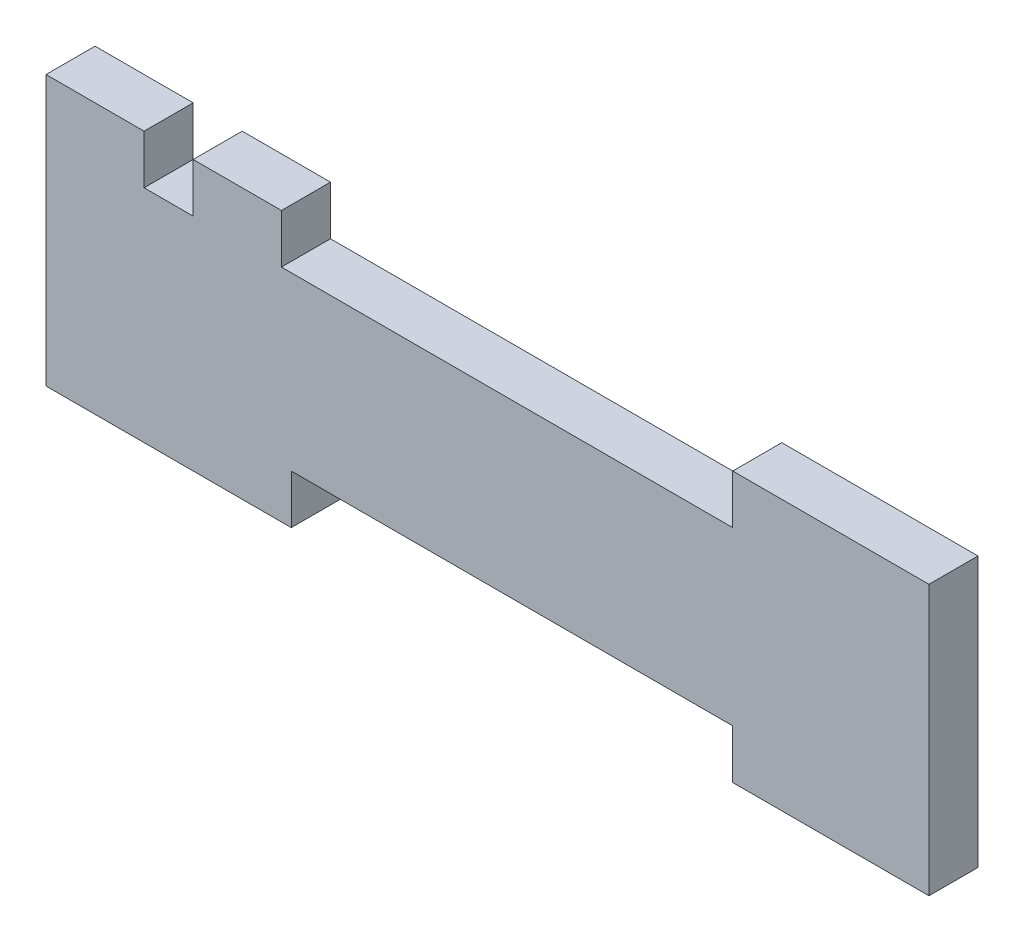
ISO-10303-21;
HEADER;
FILE_DESCRIPTION(('STEP AP214'),'2;1');
FILE_NAME('part.step','',(''),(''),'','','');
FILE_SCHEMA(('AUTOMOTIVE_DESIGN { 1 0 10303 214 1 1 1 1 }'));
ENDSEC;
DATA;
#1=APPLICATION_CONTEXT('core data for automotive mechanical design processes');
#2=APPLICATION_PROTOCOL_DEFINITION('international standard','automotive_design',2000,#1);
#3=PRODUCT_CONTEXT('',#1,'mechanical');
#4=PRODUCT('Part','Part','',(#3));
#5=PRODUCT_RELATED_PRODUCT_CATEGORY('part','',(#4));
#6=PRODUCT_DEFINITION_FORMATION('','',#4);
#7=PRODUCT_DEFINITION_CONTEXT('part definition',#1,'design');
#8=PRODUCT_DEFINITION('design','',#6,#7);
#9=PRODUCT_DEFINITION_SHAPE('','',#8);
#10=(LENGTH_UNIT() NAMED_UNIT(*) SI_UNIT(.MILLI.,.METRE.));
#11=(NAMED_UNIT(*) PLANE_ANGLE_UNIT() SI_UNIT($,.RADIAN.));
#12=(NAMED_UNIT(*) SI_UNIT($,.STERADIAN.) SOLID_ANGLE_UNIT());
#13=UNCERTAINTY_MEASURE_WITH_UNIT(LENGTH_MEASURE(1.E-05),#10,'distance_accuracy_value','');
#14=(GEOMETRIC_REPRESENTATION_CONTEXT(3) GLOBAL_UNCERTAINTY_ASSIGNED_CONTEXT((#13)) GLOBAL_UNIT_ASSIGNED_CONTEXT((#10,
#11,#12)) REPRESENTATION_CONTEXT('',''));
#15=CARTESIAN_POINT('',(0.,0.,0.));
#16=DIRECTION('',(0.,0.,1.));
#17=DIRECTION('',(1.,0.,0.));
#18=AXIS2_PLACEMENT_3D('',#15,#16,#17);
#19=CARTESIAN_POINT('',(0.,22.5,5.));
#20=DIRECTION('',(0.,1.,0.));
#21=DIRECTION('',(0.,0.,1.));
#22=AXIS2_PLACEMENT_3D('',#19,#20,#21);
#23=PLANE('',#22);
#24=DIRECTION('',(1.,0.,0.));
#25=VECTOR('',#24,1.);
#26=CARTESIAN_POINT('',(0.,22.5,5.));
#27=LINE('',#26,#25);
#28=CARTESIAN_POINT('',(-75.,22.5,5.));
#29=VERTEX_POINT('',#28);
#30=CARTESIAN_POINT('',(-66.,22.5,5.));
#31=VERTEX_POINT('',#30);
#32=EDGE_CURVE('E273',#29,#31,#27,.T.);
#33=ORIENTED_EDGE('',*,*,#32,.T.);
#34=DIRECTION('',(0.,0.,1.));
#35=VECTOR('',#34,1.);
#36=CARTESIAN_POINT('',(-66.,22.5,0.));
#37=LINE('',#36,#35);
#38=CARTESIAN_POINT('',(-66.,22.5,0.));
#39=VERTEX_POINT('',#38);
#40=EDGE_CURVE('E281',#39,#31,#37,.T.);
#41=ORIENTED_EDGE('',*,*,#40,.F.);
#42=DIRECTION('',(1.,0.,0.));
#43=VECTOR('',#42,1.);
#44=CARTESIAN_POINT('',(0.,22.5,0.));
#45=LINE('',#44,#43);
#46=CARTESIAN_POINT('',(-75.,22.5,0.));
#47=VERTEX_POINT('',#46);
#48=EDGE_CURVE('E204',#47,#39,#45,.T.);
#49=ORIENTED_EDGE('',*,*,#48,.F.);
#50=DIRECTION('',(0.,0.,-1.));
#51=VECTOR('',#50,1.);
#52=CARTESIAN_POINT('',(-75.,22.5,5.));
#53=LINE('',#52,#51);
#54=EDGE_CURVE('E218',#29,#47,#53,.T.);
#55=ORIENTED_EDGE('',*,*,#54,.F.);
#56=EDGE_LOOP('',(#33,#41,#49,#55));
#57=FACE_BOUND('',#56,.T.);
#58=ADVANCED_FACE('F32',(#57),#23,.T.);
#59=CARTESIAN_POINT('',(-90.,0.,5.));
#60=DIRECTION('',(-1.,0.,0.));
#61=DIRECTION('',(0.,0.,1.));
#62=AXIS2_PLACEMENT_3D('',#59,#60,#61);
#63=PLANE('',#62);
#64=DIRECTION('',(0.,1.,0.));
#65=VECTOR('',#64,1.);
#66=CARTESIAN_POINT('',(-90.,0.,0.));
#67=LINE('',#66,#65);
#68=CARTESIAN_POINT('',(-90.,-5.00000000000001,0.));
#69=VERTEX_POINT('',#68);
#70=CARTESIAN_POINT('',(-90.,22.5,0.));
#71=VERTEX_POINT('',#70);
#72=EDGE_CURVE('E177',#69,#71,#67,.T.);
#73=ORIENTED_EDGE('',*,*,#72,.F.);
#74=DIRECTION('',(0.,0.,-1.));
#75=VECTOR('',#74,1.);
#76=CARTESIAN_POINT('',(-90.,-5.00000000000001,5.));
#77=LINE('',#76,#75);
#78=CARTESIAN_POINT('',(-90.,-5.00000000000001,5.));
#79=VERTEX_POINT('',#78);
#80=EDGE_CURVE('E11',#79,#69,#77,.T.);
#81=ORIENTED_EDGE('',*,*,#80,.F.);
#82=DIRECTION('',(0.,1.,0.));
#83=VECTOR('',#82,1.);
#84=CARTESIAN_POINT('',(-90.,0.,5.));
#85=LINE('',#84,#83);
#86=CARTESIAN_POINT('',(-90.,22.5,5.));
#87=VERTEX_POINT('',#86);
#88=EDGE_CURVE('E214',#79,#87,#85,.T.);
#89=ORIENTED_EDGE('',*,*,#88,.T.);
#90=DIRECTION('',(0.,0.,-1.));
#91=VECTOR('',#90,1.);
#92=CARTESIAN_POINT('',(-90.,22.5,5.));
#93=LINE('',#92,#91);
#94=EDGE_CURVE('E56',#87,#71,#93,.T.);
#95=ORIENTED_EDGE('',*,*,#94,.T.);
#96=EDGE_LOOP('',(#73,#81,#89,#95));
#97=FACE_BOUND('',#96,.T.);
#98=ADVANCED_FACE('F34',(#97),#63,.T.);
#99=CARTESIAN_POINT('',(0.,-5.00000000000001,5.));
#100=DIRECTION('',(0.,1.,0.));
#101=DIRECTION('',(0.,0.,1.));
#102=AXIS2_PLACEMENT_3D('',#99,#100,#101);
#103=PLANE('',#102);
#104=DIRECTION('',(1.,0.,0.));
#105=VECTOR('',#104,1.);
#106=CARTESIAN_POINT('',(0.,-5.00000000000001,0.));
#107=LINE('',#106,#105);
#108=CARTESIAN_POINT('',(-65.,-5.00000000000001,0.));
#109=VERTEX_POINT('',#108);
#110=EDGE_CURVE('E179',#69,#109,#107,.T.);
#111=ORIENTED_EDGE('',*,*,#110,.T.);
#112=DIRECTION('',(0.,0.,-1.));
#113=VECTOR('',#112,1.);
#114=CARTESIAN_POINT('',(-65.,-5.00000000000001,5.));
#115=LINE('',#114,#113);
#116=CARTESIAN_POINT('',(-65.,-5.00000000000001,5.));
#117=VERTEX_POINT('',#116);
#118=EDGE_CURVE('E40',#117,#109,#115,.T.);
#119=ORIENTED_EDGE('',*,*,#118,.F.);
#120=DIRECTION('',(1.,0.,0.));
#121=VECTOR('',#120,1.);
#122=CARTESIAN_POINT('',(0.,-5.00000000000001,5.));
#123=LINE('',#122,#121);
#124=EDGE_CURVE('E256',#79,#117,#123,.T.);
#125=ORIENTED_EDGE('',*,*,#124,.F.);
#126=ORIENTED_EDGE('',*,*,#80,.T.);
#127=EDGE_LOOP('',(#111,#119,#125,#126));
#128=FACE_BOUND('',#127,.T.);
#129=ADVANCED_FACE('F243',(#128),#103,.F.);
#130=CARTESIAN_POINT('',(-65.,0.,5.));
#131=DIRECTION('',(1.,0.,0.));
#132=DIRECTION('',(0.,0.,-1.));
#133=AXIS2_PLACEMENT_3D('',#130,#131,#132);
#134=PLANE('',#133);
#135=DIRECTION('',(0.,-1.,0.));
#136=VECTOR('',#135,1.);
#137=CARTESIAN_POINT('',(-65.,0.,0.));
#138=LINE('',#137,#136);
#139=CARTESIAN_POINT('',(-65.,0.,0.));
#140=VERTEX_POINT('',#139);
#141=EDGE_CURVE('E183',#140,#109,#138,.T.);
#142=ORIENTED_EDGE('',*,*,#141,.F.);
#143=DIRECTION('',(0.,0.,-1.));
#144=VECTOR('',#143,1.);
#145=CARTESIAN_POINT('',(-65.,0.,5.));
#146=LINE('',#145,#144);
#147=CARTESIAN_POINT('',(-65.,0.,5.));
#148=VERTEX_POINT('',#147);
#149=EDGE_CURVE('E233',#148,#140,#146,.T.);
#150=ORIENTED_EDGE('',*,*,#149,.F.);
#151=DIRECTION('',(0.,-1.,0.));
#152=VECTOR('',#151,1.);
#153=CARTESIAN_POINT('',(-65.,0.,5.));
#154=LINE('',#153,#152);
#155=EDGE_CURVE('E240',#148,#117,#154,.T.);
#156=ORIENTED_EDGE('',*,*,#155,.T.);
#157=ORIENTED_EDGE('',*,*,#118,.T.);
#158=EDGE_LOOP('',(#142,#150,#156,#157));
#159=FACE_BOUND('',#158,.T.);
#160=ADVANCED_FACE('F238',(#159),#134,.T.);
#161=CARTESIAN_POINT('',(0.,0.,5.));
#162=DIRECTION('',(0.,-1.,0.));
#163=DIRECTION('',(1.,0.,0.));
#164=AXIS2_PLACEMENT_3D('',#161,#162,#163);
#165=PLANE('',#164);
#166=DIRECTION('',(-1.,0.,0.));
#167=VECTOR('',#166,1.);
#168=CARTESIAN_POINT('',(0.,0.,0.));
#169=LINE('',#168,#167);
#170=CARTESIAN_POINT('',(-20.,0.,0.));
#171=VERTEX_POINT('',#170);
#172=EDGE_CURVE('E186',#171,#140,#169,.T.);
#173=ORIENTED_EDGE('',*,*,#172,.F.);
#174=DIRECTION('',(0.,0.,-1.));
#175=VECTOR('',#174,1.);
#176=CARTESIAN_POINT('',(-20.,0.,5.));
#177=LINE('',#176,#175);
#178=CARTESIAN_POINT('',(-20.,0.,5.));
#179=VERTEX_POINT('',#178);
#180=EDGE_CURVE('E231',#179,#171,#177,.T.);
#181=ORIENTED_EDGE('',*,*,#180,.F.);
#182=DIRECTION('',(-1.,0.,0.));
#183=VECTOR('',#182,1.);
#184=CARTESIAN_POINT('',(0.,0.,5.));
#185=LINE('',#184,#183);
#186=EDGE_CURVE('E254',#179,#148,#185,.T.);
#187=ORIENTED_EDGE('',*,*,#186,.T.);
#188=ORIENTED_EDGE('',*,*,#149,.T.);
#189=EDGE_LOOP('',(#173,#181,#187,#188));
#190=FACE_BOUND('',#189,.T.);
#191=ADVANCED_FACE('F250',(#190),#165,.T.);
#192=CARTESIAN_POINT('',(-20.,0.,5.));
#193=DIRECTION('',(1.,0.,0.));
#194=DIRECTION('',(0.,0.,-1.));
#195=AXIS2_PLACEMENT_3D('',#192,#193,#194);
#196=PLANE('',#195);
#197=DIRECTION('',(0.,-1.,0.));
#198=VECTOR('',#197,1.);
#199=CARTESIAN_POINT('',(-20.,0.,0.));
#200=LINE('',#199,#198);
#201=CARTESIAN_POINT('',(-20.,-5.00000000000001,0.));
#202=VERTEX_POINT('',#201);
#203=EDGE_CURVE('E189',#171,#202,#200,.T.);
#204=ORIENTED_EDGE('',*,*,#203,.T.);
#205=DIRECTION('',(0.,0.,-1.));
#206=VECTOR('',#205,1.);
#207=CARTESIAN_POINT('',(-20.,-5.00000000000001,5.));
#208=LINE('',#207,#206);
#209=CARTESIAN_POINT('',(-20.,-5.00000000000001,5.));
#210=VERTEX_POINT('',#209);
#211=EDGE_CURVE('E229',#210,#202,#208,.T.);
#212=ORIENTED_EDGE('',*,*,#211,.F.);
#213=DIRECTION('',(0.,-1.,0.));
#214=VECTOR('',#213,1.);
#215=CARTESIAN_POINT('',(-20.,0.,5.));
#216=LINE('',#215,#214);
#217=EDGE_CURVE('E258',#179,#210,#216,.T.);
#218=ORIENTED_EDGE('',*,*,#217,.F.);
#219=ORIENTED_EDGE('',*,*,#180,.T.);
#220=EDGE_LOOP('',(#204,#212,#218,#219));
#221=FACE_BOUND('',#220,.T.);
#222=ADVANCED_FACE('F324',(#221),#196,.F.);
#223=CARTESIAN_POINT('',(0.,-5.,5.));
#224=DIRECTION('',(0.,-1.,0.));
#225=DIRECTION('',(1.,0.,0.));
#226=AXIS2_PLACEMENT_3D('',#223,#224,#225);
#227=PLANE('',#226);
#228=DIRECTION('',(-1.,0.,0.));
#229=VECTOR('',#228,1.);
#230=CARTESIAN_POINT('',(0.,-5.,0.));
#231=LINE('',#230,#229);
#232=CARTESIAN_POINT('',(0.,-5.,0.));
#233=VERTEX_POINT('',#232);
#234=EDGE_CURVE('E192',#233,#202,#231,.T.);
#235=ORIENTED_EDGE('',*,*,#234,.F.);
#236=DIRECTION('',(0.,0.,-1.));
#237=VECTOR('',#236,1.);
#238=CARTESIAN_POINT('',(0.,-5.,5.));
#239=LINE('',#238,#237);
#240=CARTESIAN_POINT('',(0.,-5.,5.));
#241=VERTEX_POINT('',#240);
#242=EDGE_CURVE('E227',#241,#233,#239,.T.);
#243=ORIENTED_EDGE('',*,*,#242,.F.);
#244=DIRECTION('',(-1.,0.,0.));
#245=VECTOR('',#244,1.);
#246=CARTESIAN_POINT('',(0.,-5.,5.));
#247=LINE('',#246,#245);
#248=EDGE_CURVE('E264',#241,#210,#247,.T.);
#249=ORIENTED_EDGE('',*,*,#248,.T.);
#250=ORIENTED_EDGE('',*,*,#211,.T.);
#251=EDGE_LOOP('',(#235,#243,#249,#250));
#252=FACE_BOUND('',#251,.T.);
#253=ADVANCED_FACE('F320',(#252),#227,.T.);
#254=CARTESIAN_POINT('',(0.,0.,5.));
#255=DIRECTION('',(-1.,0.,0.));
#256=DIRECTION('',(0.,0.,1.));
#257=AXIS2_PLACEMENT_3D('',#254,#255,#256);
#258=PLANE('',#257);
#259=DIRECTION('',(0.,1.,0.));
#260=VECTOR('',#259,1.);
#261=CARTESIAN_POINT('',(0.,0.,0.));
#262=LINE('',#261,#260);
#263=CARTESIAN_POINT('',(0.,22.5,0.));
#264=VERTEX_POINT('',#263);
#265=EDGE_CURVE('E195',#233,#264,#262,.T.);
#266=ORIENTED_EDGE('',*,*,#265,.T.);
#267=DIRECTION('',(0.,0.,-1.));
#268=VECTOR('',#267,1.);
#269=CARTESIAN_POINT('',(0.,22.5,5.));
#270=LINE('',#269,#268);
#271=CARTESIAN_POINT('',(0.,22.5,5.));
#272=VERTEX_POINT('',#271);
#273=EDGE_CURVE('E224',#272,#264,#270,.T.);
#274=ORIENTED_EDGE('',*,*,#273,.F.);
#275=DIRECTION('',(0.,1.,0.));
#276=VECTOR('',#275,1.);
#277=CARTESIAN_POINT('',(0.,0.,5.));
#278=LINE('',#277,#276);
#279=EDGE_CURVE('E267',#241,#272,#278,.T.);
#280=ORIENTED_EDGE('',*,*,#279,.F.);
#281=ORIENTED_EDGE('',*,*,#242,.T.);
#282=EDGE_LOOP('',(#266,#274,#280,#281));
#283=FACE_BOUND('',#282,.T.);
#284=ADVANCED_FACE('F316',(#283),#258,.F.);
#285=CARTESIAN_POINT('',(0.,22.5,5.));
#286=DIRECTION('',(0.,-1.,0.));
#287=DIRECTION('',(1.,0.,0.));
#288=AXIS2_PLACEMENT_3D('',#285,#286,#287);
#289=PLANE('',#288);
#290=DIRECTION('',(-1.,0.,0.));
#291=VECTOR('',#290,1.);
#292=CARTESIAN_POINT('',(0.,22.5,0.));
#293=LINE('',#292,#291);
#294=CARTESIAN_POINT('',(-20.,22.5,0.));
#295=VERTEX_POINT('',#294);
#296=EDGE_CURVE('E197',#264,#295,#293,.T.);
#297=ORIENTED_EDGE('',*,*,#296,.T.);
#298=DIRECTION('',(0.,0.,-1.));
#299=VECTOR('',#298,1.);
#300=CARTESIAN_POINT('',(-20.,22.5,5.));
#301=LINE('',#300,#299);
#302=CARTESIAN_POINT('',(-20.,22.5,5.));
#303=VERTEX_POINT('',#302);
#304=EDGE_CURVE('E222',#303,#295,#301,.T.);
#305=ORIENTED_EDGE('',*,*,#304,.F.);
#306=DIRECTION('',(-1.,0.,0.));
#307=VECTOR('',#306,1.);
#308=CARTESIAN_POINT('',(0.,22.5,5.));
#309=LINE('',#308,#307);
#310=EDGE_CURVE('E269',#272,#303,#309,.T.);
#311=ORIENTED_EDGE('',*,*,#310,.F.);
#312=ORIENTED_EDGE('',*,*,#273,.T.);
#313=EDGE_LOOP('',(#297,#305,#311,#312));
#314=FACE_BOUND('',#313,.T.);
#315=ADVANCED_FACE('F312',(#314),#289,.F.);
#316=CARTESIAN_POINT('',(-20.,0.,5.));
#317=DIRECTION('',(-1.,0.,0.));
#318=DIRECTION('',(0.,0.,1.));
#319=AXIS2_PLACEMENT_3D('',#316,#317,#318);
#320=PLANE('',#319);
#321=DIRECTION('',(0.,1.,0.));
#322=VECTOR('',#321,1.);
#323=CARTESIAN_POINT('',(-20.,0.,0.));
#324=LINE('',#323,#322);
#325=CARTESIAN_POINT('',(-20.,17.5,0.));
#326=VERTEX_POINT('',#325);
#327=EDGE_CURVE('E200',#326,#295,#324,.T.);
#328=ORIENTED_EDGE('',*,*,#327,.F.);
#329=DIRECTION('',(0.,0.,-1.));
#330=VECTOR('',#329,1.);
#331=CARTESIAN_POINT('',(-20.,17.5,5.));
#332=LINE('',#331,#330);
#333=CARTESIAN_POINT('',(-20.,17.5,5.));
#334=VERTEX_POINT('',#333);
#335=EDGE_CURVE('E220',#334,#326,#332,.T.);
#336=ORIENTED_EDGE('',*,*,#335,.F.);
#337=DIRECTION('',(0.,1.,0.));
#338=VECTOR('',#337,1.);
#339=CARTESIAN_POINT('',(-20.,0.,5.));
#340=LINE('',#339,#338);
#341=EDGE_CURVE('E271',#334,#303,#340,.T.);
#342=ORIENTED_EDGE('',*,*,#341,.T.);
#343=ORIENTED_EDGE('',*,*,#304,.T.);
#344=EDGE_LOOP('',(#328,#336,#342,#343));
#345=FACE_BOUND('',#344,.T.);
#346=ADVANCED_FACE('F303',(#345),#320,.T.);
#347=CARTESIAN_POINT('',(0.,17.5,5.));
#348=DIRECTION('',(0.,-1.,0.));
#349=DIRECTION('',(1.,0.,0.));
#350=AXIS2_PLACEMENT_3D('',#347,#348,#349);
#351=PLANE('',#350);
#352=DIRECTION('',(-1.,0.,0.));
#353=VECTOR('',#352,1.);
#354=CARTESIAN_POINT('',(0.,17.5,0.));
#355=LINE('',#354,#353);
#356=CARTESIAN_POINT('',(-66.,17.5,0.));
#357=VERTEX_POINT('',#356);
#358=EDGE_CURVE('E47',#326,#357,#355,.T.);
#359=ORIENTED_EDGE('',*,*,#358,.T.);
#360=DIRECTION('',(0.,0.,-1.));
#361=VECTOR('',#360,1.);
#362=CARTESIAN_POINT('',(-66.,17.5,5.));
#363=LINE('',#362,#361);
#364=CARTESIAN_POINT('',(-66.,17.5,5.));
#365=VERTEX_POINT('',#364);
#366=EDGE_CURVE('E503',#365,#357,#363,.T.);
#367=ORIENTED_EDGE('',*,*,#366,.F.);
#368=DIRECTION('',(-1.,0.,0.));
#369=VECTOR('',#368,1.);
#370=CARTESIAN_POINT('',(0.,17.5,5.));
#371=LINE('',#370,#369);
#372=EDGE_CURVE('E158',#334,#365,#371,.T.);
#373=ORIENTED_EDGE('',*,*,#372,.F.);
#374=ORIENTED_EDGE('',*,*,#335,.T.);
#375=EDGE_LOOP('',(#359,#367,#373,#374));
#376=FACE_BOUND('',#375,.T.);
#377=ADVANCED_FACE('F296',(#376),#351,.F.);
#378=CARTESIAN_POINT('',(-75.,0.,5.));
#379=DIRECTION('',(1.,0.,0.));
#380=DIRECTION('',(0.,0.,-1.));
#381=AXIS2_PLACEMENT_3D('',#378,#379,#380);
#382=PLANE('',#381);
#383=DIRECTION('',(0.,-1.,0.));
#384=VECTOR('',#383,1.);
#385=CARTESIAN_POINT('',(-75.,0.,0.));
#386=LINE('',#385,#384);
#387=CARTESIAN_POINT('',(-75.,17.5,0.));
#388=VERTEX_POINT('',#387);
#389=EDGE_CURVE('E207',#47,#388,#386,.T.);
#390=ORIENTED_EDGE('',*,*,#389,.T.);
#391=DIRECTION('',(0.,0.,-1.));
#392=VECTOR('',#391,1.);
#393=CARTESIAN_POINT('',(-75.,17.5,5.));
#394=LINE('',#393,#392);
#395=CARTESIAN_POINT('',(-75.,17.5,5.));
#396=VERTEX_POINT('',#395);
#397=EDGE_CURVE('E167',#396,#388,#394,.T.);
#398=ORIENTED_EDGE('',*,*,#397,.F.);
#399=DIRECTION('',(0.,-1.,0.));
#400=VECTOR('',#399,1.);
#401=CARTESIAN_POINT('',(-75.,0.,5.));
#402=LINE('',#401,#400);
#403=EDGE_CURVE('E153',#29,#396,#402,.T.);
#404=ORIENTED_EDGE('',*,*,#403,.F.);
#405=ORIENTED_EDGE('',*,*,#54,.T.);
#406=EDGE_LOOP('',(#390,#398,#404,#405));
#407=FACE_BOUND('',#406,.T.);
#408=ADVANCED_FACE('F294',(#407),#382,.F.);
#409=CARTESIAN_POINT('',(-80.,17.5,0.));
#410=VERTEX_POINT('',#409);
#411=EDGE_CURVE('E163',#388,#410,#355,.T.);
#412=ORIENTED_EDGE('',*,*,#411,.T.);
#413=DIRECTION('',(0.,0.,-1.));
#414=VECTOR('',#413,1.);
#415=CARTESIAN_POINT('',(-80.,17.5,5.));
#416=LINE('',#415,#414);
#417=CARTESIAN_POINT('',(-80.,17.5,5.));
#418=VERTEX_POINT('',#417);
#419=EDGE_CURVE('E160',#418,#410,#416,.T.);
#420=ORIENTED_EDGE('',*,*,#419,.F.);
#421=EDGE_CURVE('E144',#396,#418,#371,.T.);
#422=ORIENTED_EDGE('',*,*,#421,.F.);
#423=ORIENTED_EDGE('',*,*,#397,.T.);
#424=EDGE_LOOP('',(#412,#420,#422,#423));
#425=FACE_BOUND('',#424,.T.);
#426=ADVANCED_FACE('F161',(#425),#351,.F.);
#427=CARTESIAN_POINT('',(-80.,0.,5.));
#428=DIRECTION('',(1.,0.,0.));
#429=DIRECTION('',(0.,0.,-1.));
#430=AXIS2_PLACEMENT_3D('',#427,#428,#429);
#431=PLANE('',#430);
#432=DIRECTION('',(0.,-1.,0.));
#433=VECTOR('',#432,1.);
#434=CARTESIAN_POINT('',(-80.,0.,0.));
#435=LINE('',#434,#433);
#436=CARTESIAN_POINT('',(-80.,22.5,0.));
#437=VERTEX_POINT('',#436);
#438=EDGE_CURVE('E209',#437,#410,#435,.T.);
#439=ORIENTED_EDGE('',*,*,#438,.F.);
#440=DIRECTION('',(0.,0.,-1.));
#441=VECTOR('',#440,1.);
#442=CARTESIAN_POINT('',(-80.,22.5,5.));
#443=LINE('',#442,#441);
#444=CARTESIAN_POINT('',(-80.,22.5,5.));
#445=VERTEX_POINT('',#444);
#446=EDGE_CURVE('E168',#445,#437,#443,.T.);
#447=ORIENTED_EDGE('',*,*,#446,.F.);
#448=DIRECTION('',(0.,-1.,0.));
#449=VECTOR('',#448,1.);
#450=CARTESIAN_POINT('',(-80.,0.,5.));
#451=LINE('',#450,#449);
#452=EDGE_CURVE('E150',#445,#418,#451,.T.);
#453=ORIENTED_EDGE('',*,*,#452,.T.);
#454=ORIENTED_EDGE('',*,*,#419,.T.);
#455=EDGE_LOOP('',(#439,#447,#453,#454));
#456=FACE_BOUND('',#455,.T.);
#457=ADVANCED_FACE('F170',(#456),#431,.T.);
#458=CARTESIAN_POINT('',(0.,22.5,5.));
#459=DIRECTION('',(0.,1.,0.));
#460=DIRECTION('',(0.,0.,1.));
#461=AXIS2_PLACEMENT_3D('',#458,#459,#460);
#462=PLANE('',#461);
#463=DIRECTION('',(1.,0.,0.));
#464=VECTOR('',#463,1.);
#465=CARTESIAN_POINT('',(0.,22.5,0.));
#466=LINE('',#465,#464);
#467=EDGE_CURVE('E211',#71,#437,#466,.T.);
#468=ORIENTED_EDGE('',*,*,#467,.F.);
#469=ORIENTED_EDGE('',*,*,#94,.F.);
#470=DIRECTION('',(1.,0.,0.));
#471=VECTOR('',#470,1.);
#472=CARTESIAN_POINT('',(0.,22.5,5.));
#473=LINE('',#472,#471);
#474=EDGE_CURVE('E171',#87,#445,#473,.T.);
#475=ORIENTED_EDGE('',*,*,#474,.T.);
#476=ORIENTED_EDGE('',*,*,#446,.T.);
#477=EDGE_LOOP('',(#468,#469,#475,#476));
#478=FACE_BOUND('',#477,.T.);
#479=ADVANCED_FACE('F291',(#478),#462,.T.);
#480=CARTESIAN_POINT('',(0.,0.,5.));
#481=DIRECTION('',(0.,0.,1.));
#482=DIRECTION('',(1.,0.,0.));
#483=AXIS2_PLACEMENT_3D('',#480,#481,#482);
#484=PLANE('',#483);
#485=ORIENTED_EDGE('',*,*,#372,.T.);
#486=DIRECTION('',(0.,-1.,0.));
#487=VECTOR('',#486,1.);
#488=CARTESIAN_POINT('',(-66.,22.5,5.));
#489=LINE('',#488,#487);
#490=EDGE_CURVE('E180',#31,#365,#489,.T.);
#491=ORIENTED_EDGE('',*,*,#490,.F.);
#492=ORIENTED_EDGE('',*,*,#32,.F.);
#493=ORIENTED_EDGE('',*,*,#403,.T.);
#494=ORIENTED_EDGE('',*,*,#421,.T.);
#495=ORIENTED_EDGE('',*,*,#452,.F.);
#496=ORIENTED_EDGE('',*,*,#474,.F.);
#497=ORIENTED_EDGE('',*,*,#88,.F.);
#498=ORIENTED_EDGE('',*,*,#124,.T.);
#499=ORIENTED_EDGE('',*,*,#155,.F.);
#500=ORIENTED_EDGE('',*,*,#186,.F.);
#501=ORIENTED_EDGE('',*,*,#217,.T.);
#502=ORIENTED_EDGE('',*,*,#248,.F.);
#503=ORIENTED_EDGE('',*,*,#279,.T.);
#504=ORIENTED_EDGE('',*,*,#310,.T.);
#505=ORIENTED_EDGE('',*,*,#341,.F.);
#506=EDGE_LOOP('',(#485,#491,#492,#493,#494,#495,#496,#497,#498,#499,#500,#501,#502,#503,#504,#505));
#507=FACE_BOUND('',#506,.T.);
#508=ADVANCED_FACE('F147',(#507),#484,.T.);
#509=CARTESIAN_POINT('',(0.,0.,0.));
#510=DIRECTION('',(0.,0.,1.));
#511=DIRECTION('',(1.,0.,0.));
#512=AXIS2_PLACEMENT_3D('',#509,#510,#511);
#513=PLANE('',#512);
#514=DIRECTION('',(0.,1.,0.));
#515=VECTOR('',#514,1.);
#516=CARTESIAN_POINT('',(-66.,17.5,0.));
#517=LINE('',#516,#515);
#518=EDGE_CURVE('E288',#357,#39,#517,.T.);
#519=ORIENTED_EDGE('',*,*,#518,.F.);
#520=ORIENTED_EDGE('',*,*,#358,.F.);
#521=ORIENTED_EDGE('',*,*,#327,.T.);
#522=ORIENTED_EDGE('',*,*,#296,.F.);
#523=ORIENTED_EDGE('',*,*,#265,.F.);
#524=ORIENTED_EDGE('',*,*,#234,.T.);
#525=ORIENTED_EDGE('',*,*,#203,.F.);
#526=ORIENTED_EDGE('',*,*,#172,.T.);
#527=ORIENTED_EDGE('',*,*,#141,.T.);
#528=ORIENTED_EDGE('',*,*,#110,.F.);
#529=ORIENTED_EDGE('',*,*,#72,.T.);
#530=ORIENTED_EDGE('',*,*,#467,.T.);
#531=ORIENTED_EDGE('',*,*,#438,.T.);
#532=ORIENTED_EDGE('',*,*,#411,.F.);
#533=ORIENTED_EDGE('',*,*,#389,.F.);
#534=ORIENTED_EDGE('',*,*,#48,.T.);
#535=EDGE_LOOP('',(#519,#520,#521,#522,#523,#524,#525,#526,#527,#528,#529,#530,#531,#532,#533,#534));
#536=FACE_BOUND('',#535,.T.);
#537=ADVANCED_FACE('F246',(#536),#513,.F.);
#538=CARTESIAN_POINT('',(-66.,0.,0.));
#539=DIRECTION('',(1.,0.,0.));
#540=DIRECTION('',(0.,0.,-1.));
#541=AXIS2_PLACEMENT_3D('',#538,#539,#540);
#542=PLANE('',#541);
#543=ORIENTED_EDGE('',*,*,#366,.T.);
#544=ORIENTED_EDGE('',*,*,#518,.T.);
#545=ORIENTED_EDGE('',*,*,#40,.T.);
#546=ORIENTED_EDGE('',*,*,#490,.T.);
#547=EDGE_LOOP('',(#543,#544,#545,#546));
#548=FACE_BOUND('',#547,.T.);
#549=ADVANCED_FACE('F394',(#548),#542,.T.);
#550=CLOSED_SHELL('',(#58,#98,#129,#160,#191,#222,#253,#284,#315,#346,#377,#408,#426,#457,#479,
#508,#537,#549));
#551=MANIFOLD_SOLID_BREP('B2',#550);
#552=ADVANCED_BREP_SHAPE_REPRESENTATION('',(#18,#551),#14);
#553=SHAPE_DEFINITION_REPRESENTATION(#9,#552);
ENDSEC;
END-ISO-10303-21;
